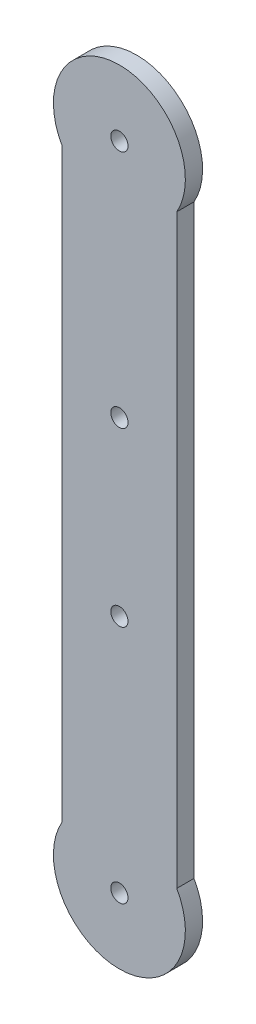
ISO-10303-21;
HEADER;
FILE_DESCRIPTION(('STEP AP214'),'2;1');
FILE_NAME('part.step','',(''),(''),'','','');
FILE_SCHEMA(('AUTOMOTIVE_DESIGN { 1 0 10303 214 1 1 1 1 }'));
ENDSEC;
DATA;
#1=APPLICATION_CONTEXT('core data for automotive mechanical design processes');
#2=APPLICATION_PROTOCOL_DEFINITION('international standard','automotive_design',2000,#1);
#3=PRODUCT_CONTEXT('',#1,'mechanical');
#4=PRODUCT('Part','Part','',(#3));
#5=PRODUCT_RELATED_PRODUCT_CATEGORY('part','',(#4));
#6=PRODUCT_DEFINITION_FORMATION('','',#4);
#7=PRODUCT_DEFINITION_CONTEXT('part definition',#1,'design');
#8=PRODUCT_DEFINITION('design','',#6,#7);
#9=PRODUCT_DEFINITION_SHAPE('','',#8);
#10=(LENGTH_UNIT() NAMED_UNIT(*) SI_UNIT(.MILLI.,.METRE.));
#11=(NAMED_UNIT(*) PLANE_ANGLE_UNIT() SI_UNIT($,.RADIAN.));
#12=(NAMED_UNIT(*) SI_UNIT($,.STERADIAN.) SOLID_ANGLE_UNIT());
#13=UNCERTAINTY_MEASURE_WITH_UNIT(LENGTH_MEASURE(1.E-05),#10,'distance_accuracy_value','');
#14=(GEOMETRIC_REPRESENTATION_CONTEXT(3) GLOBAL_UNCERTAINTY_ASSIGNED_CONTEXT((#13)) GLOBAL_UNIT_ASSIGNED_CONTEXT((#10,
#11,#12)) REPRESENTATION_CONTEXT('',''));
#15=CARTESIAN_POINT('',(0.,0.,0.));
#16=DIRECTION('',(0.,0.,1.));
#17=DIRECTION('',(1.,0.,0.));
#18=AXIS2_PLACEMENT_3D('',#15,#16,#17);
#19=CARTESIAN_POINT('',(0.,-56.75,3.));
#20=DIRECTION('',(0.,0.,-1.));
#21=DIRECTION('',(-1.,0.,0.));
#22=AXIS2_PLACEMENT_3D('',#19,#20,#21);
#23=CYLINDRICAL_SURFACE('',#22,11.5);
#24=CARTESIAN_POINT('',(0.,-56.75,0.));
#25=DIRECTION('',(0.,0.,1.));
#26=DIRECTION('',(1.,0.,0.));
#27=AXIS2_PLACEMENT_3D('',#24,#25,#26);
#28=CIRCLE('',#27,11.5);
#29=CARTESIAN_POINT('',(-10.,-51.0710916541997,0.));
#30=VERTEX_POINT('',#29);
#31=CARTESIAN_POINT('',(10.,-51.0710916541997,0.));
#32=VERTEX_POINT('',#31);
#33=EDGE_CURVE('E109',#30,#32,#28,.T.);
#34=ORIENTED_EDGE('',*,*,#33,.T.);
#35=DIRECTION('',(0.,0.,-1.));
#36=VECTOR('',#35,1.);
#37=CARTESIAN_POINT('',(10.,-51.0710916541997,3.));
#38=LINE('',#37,#36);
#39=CARTESIAN_POINT('',(10.,-51.0710916541997,3.));
#40=VERTEX_POINT('',#39);
#41=EDGE_CURVE('E11',#40,#32,#38,.T.);
#42=ORIENTED_EDGE('',*,*,#41,.F.);
#43=CARTESIAN_POINT('',(0.,-56.75,3.));
#44=DIRECTION('',(0.,0.,1.));
#45=DIRECTION('',(1.,0.,0.));
#46=AXIS2_PLACEMENT_3D('',#43,#44,#45);
#47=CIRCLE('',#46,11.5);
#48=CARTESIAN_POINT('',(-10.,-51.0710916541997,3.));
#49=VERTEX_POINT('',#48);
#50=EDGE_CURVE('E91',#49,#40,#47,.T.);
#51=ORIENTED_EDGE('',*,*,#50,.F.);
#52=DIRECTION('',(0.,0.,-1.));
#53=VECTOR('',#52,1.);
#54=CARTESIAN_POINT('',(-10.,-51.0710916541997,3.));
#55=LINE('',#54,#53);
#56=EDGE_CURVE('E58',#49,#30,#55,.T.);
#57=ORIENTED_EDGE('',*,*,#56,.T.);
#58=EDGE_LOOP('',(#34,#42,#51,#57));
#59=FACE_BOUND('',#58,.T.);
#60=ADVANCED_FACE('F41',(#59),#23,.T.);
#61=CARTESIAN_POINT('',(10.,0.,3.));
#62=DIRECTION('',(-1.,0.,0.));
#63=DIRECTION('',(0.,0.,1.));
#64=AXIS2_PLACEMENT_3D('',#61,#62,#63);
#65=PLANE('',#64);
#66=DIRECTION('',(0.,1.,0.));
#67=VECTOR('',#66,1.);
#68=CARTESIAN_POINT('',(10.,0.,0.));
#69=LINE('',#68,#67);
#70=CARTESIAN_POINT('',(10.,51.0710916541997,0.));
#71=VERTEX_POINT('',#70);
#72=EDGE_CURVE('E97',#32,#71,#69,.T.);
#73=ORIENTED_EDGE('',*,*,#72,.T.);
#74=DIRECTION('',(0.,0.,-1.));
#75=VECTOR('',#74,1.);
#76=CARTESIAN_POINT('',(10.,51.0710916541997,3.));
#77=LINE('',#76,#75);
#78=CARTESIAN_POINT('',(10.,51.0710916541997,3.));
#79=VERTEX_POINT('',#78);
#80=EDGE_CURVE('E50',#79,#71,#77,.T.);
#81=ORIENTED_EDGE('',*,*,#80,.F.);
#82=DIRECTION('',(0.,1.,0.));
#83=VECTOR('',#82,1.);
#84=CARTESIAN_POINT('',(10.,0.,3.));
#85=LINE('',#84,#83);
#86=EDGE_CURVE('E84',#40,#79,#85,.T.);
#87=ORIENTED_EDGE('',*,*,#86,.F.);
#88=ORIENTED_EDGE('',*,*,#41,.T.);
#89=EDGE_LOOP('',(#73,#81,#87,#88));
#90=FACE_BOUND('',#89,.T.);
#91=ADVANCED_FACE('F96',(#90),#65,.F.);
#92=CARTESIAN_POINT('',(0.,56.75,3.));
#93=DIRECTION('',(0.,0.,-1.));
#94=DIRECTION('',(-1.,0.,0.));
#95=AXIS2_PLACEMENT_3D('',#92,#93,#94);
#96=CYLINDRICAL_SURFACE('',#95,11.5);
#97=CARTESIAN_POINT('',(0.,56.75,0.));
#98=DIRECTION('',(0.,0.,1.));
#99=DIRECTION('',(1.,0.,0.));
#100=AXIS2_PLACEMENT_3D('',#97,#98,#99);
#101=CIRCLE('',#100,11.5);
#102=CARTESIAN_POINT('',(-10.,51.0710916541997,0.));
#103=VERTEX_POINT('',#102);
#104=EDGE_CURVE('E115',#71,#103,#101,.T.);
#105=ORIENTED_EDGE('',*,*,#104,.T.);
#106=DIRECTION('',(0.,0.,-1.));
#107=VECTOR('',#106,1.);
#108=CARTESIAN_POINT('',(-10.,51.0710916541997,3.));
#109=LINE('',#108,#107);
#110=CARTESIAN_POINT('',(-10.,51.0710916541997,3.));
#111=VERTEX_POINT('',#110);
#112=EDGE_CURVE('E73',#111,#103,#109,.T.);
#113=ORIENTED_EDGE('',*,*,#112,.F.);
#114=CARTESIAN_POINT('',(0.,56.75,3.));
#115=DIRECTION('',(0.,0.,1.));
#116=DIRECTION('',(1.,0.,0.));
#117=AXIS2_PLACEMENT_3D('',#114,#115,#116);
#118=CIRCLE('',#117,11.5);
#119=EDGE_CURVE('E90',#79,#111,#118,.T.);
#120=ORIENTED_EDGE('',*,*,#119,.F.);
#121=ORIENTED_EDGE('',*,*,#80,.T.);
#122=EDGE_LOOP('',(#105,#113,#120,#121));
#123=FACE_BOUND('',#122,.T.);
#124=ADVANCED_FACE('F101',(#123),#96,.T.);
#125=CARTESIAN_POINT('',(-10.,0.,3.));
#126=DIRECTION('',(-1.,0.,0.));
#127=DIRECTION('',(0.,0.,1.));
#128=AXIS2_PLACEMENT_3D('',#125,#126,#127);
#129=PLANE('',#128);
#130=DIRECTION('',(0.,1.,0.));
#131=VECTOR('',#130,1.);
#132=CARTESIAN_POINT('',(-10.,0.,0.));
#133=LINE('',#132,#131);
#134=EDGE_CURVE('E118',#30,#103,#133,.T.);
#135=ORIENTED_EDGE('',*,*,#134,.F.);
#136=ORIENTED_EDGE('',*,*,#56,.F.);
#137=DIRECTION('',(0.,1.,0.));
#138=VECTOR('',#137,1.);
#139=CARTESIAN_POINT('',(-10.,0.,3.));
#140=LINE('',#139,#138);
#141=EDGE_CURVE('E103',#49,#111,#140,.T.);
#142=ORIENTED_EDGE('',*,*,#141,.T.);
#143=ORIENTED_EDGE('',*,*,#112,.T.);
#144=EDGE_LOOP('',(#135,#136,#142,#143));
#145=FACE_BOUND('',#144,.T.);
#146=ADVANCED_FACE('F173',(#145),#129,.T.);
#147=CARTESIAN_POINT('',(0.,0.,3.));
#148=DIRECTION('',(0.,0.,1.));
#149=DIRECTION('',(1.,0.,0.));
#150=AXIS2_PLACEMENT_3D('',#147,#148,#149);
#151=PLANE('',#150);
#152=CARTESIAN_POINT('',(0.,56.75,3.));
#153=DIRECTION('',(0.,0.,1.));
#154=DIRECTION('',(1.,0.,0.));
#155=AXIS2_PLACEMENT_3D('',#152,#153,#154);
#156=CIRCLE('',#155,1.5);
#157=CARTESIAN_POINT('',(1.5,56.75,3.));
#158=VERTEX_POINT('',#157);
#159=EDGE_CURVE('E136',#158,#158,#156,.T.);
#160=ORIENTED_EDGE('',*,*,#159,.F.);
#161=EDGE_LOOP('',(#160));
#162=FACE_BOUND('',#161,.T.);
#163=CARTESIAN_POINT('',(0.,-56.75,3.));
#164=DIRECTION('',(0.,0.,1.));
#165=DIRECTION('',(1.,0.,0.));
#166=AXIS2_PLACEMENT_3D('',#163,#164,#165);
#167=CIRCLE('',#166,1.5);
#168=CARTESIAN_POINT('',(1.5,-56.75,3.));
#169=VERTEX_POINT('',#168);
#170=EDGE_CURVE('E144',#169,#169,#167,.T.);
#171=ORIENTED_EDGE('',*,*,#170,.F.);
#172=EDGE_LOOP('',(#171));
#173=FACE_BOUND('',#172,.T.);
#174=CARTESIAN_POINT('',(0.,-15.,3.));
#175=DIRECTION('',(0.,0.,1.));
#176=DIRECTION('',(1.,0.,0.));
#177=AXIS2_PLACEMENT_3D('',#174,#175,#176);
#178=CIRCLE('',#177,1.5);
#179=CARTESIAN_POINT('',(1.5,-15.,3.));
#180=VERTEX_POINT('',#179);
#181=EDGE_CURVE('E152',#180,#180,#178,.T.);
#182=ORIENTED_EDGE('',*,*,#181,.F.);
#183=EDGE_LOOP('',(#182));
#184=FACE_BOUND('',#183,.T.);
#185=CARTESIAN_POINT('',(0.,15.,3.));
#186=DIRECTION('',(0.,0.,1.));
#187=DIRECTION('',(1.,0.,0.));
#188=AXIS2_PLACEMENT_3D('',#185,#186,#187);
#189=CIRCLE('',#188,1.5);
#190=CARTESIAN_POINT('',(1.5,15.,3.));
#191=VERTEX_POINT('',#190);
#192=EDGE_CURVE('E128',#191,#191,#189,.T.);
#193=ORIENTED_EDGE('',*,*,#192,.F.);
#194=EDGE_LOOP('',(#193));
#195=FACE_BOUND('',#194,.T.);
#196=ORIENTED_EDGE('',*,*,#50,.T.);
#197=ORIENTED_EDGE('',*,*,#86,.T.);
#198=ORIENTED_EDGE('',*,*,#119,.T.);
#199=ORIENTED_EDGE('',*,*,#141,.F.);
#200=EDGE_LOOP('',(#196,#197,#198,#199));
#201=FACE_BOUND('',#200,.T.);
#202=ADVANCED_FACE('F87',(#162,#173,#184,#195,#201),#151,.T.);
#203=CARTESIAN_POINT('',(0.,0.,0.));
#204=DIRECTION('',(0.,0.,1.));
#205=DIRECTION('',(1.,0.,0.));
#206=AXIS2_PLACEMENT_3D('',#203,#204,#205);
#207=PLANE('',#206);
#208=CARTESIAN_POINT('',(0.,56.75,0.));
#209=DIRECTION('',(0.,0.,1.));
#210=DIRECTION('',(1.,0.,0.));
#211=AXIS2_PLACEMENT_3D('',#208,#209,#210);
#212=CIRCLE('',#211,1.5);
#213=CARTESIAN_POINT('',(1.5,56.75,0.));
#214=VERTEX_POINT('',#213);
#215=EDGE_CURVE('E140',#214,#214,#212,.T.);
#216=ORIENTED_EDGE('',*,*,#215,.T.);
#217=EDGE_LOOP('',(#216));
#218=FACE_BOUND('',#217,.T.);
#219=CARTESIAN_POINT('',(0.,-56.75,0.));
#220=DIRECTION('',(0.,0.,1.));
#221=DIRECTION('',(1.,0.,0.));
#222=AXIS2_PLACEMENT_3D('',#219,#220,#221);
#223=CIRCLE('',#222,1.5);
#224=CARTESIAN_POINT('',(1.5,-56.75,0.));
#225=VERTEX_POINT('',#224);
#226=EDGE_CURVE('E148',#225,#225,#223,.T.);
#227=ORIENTED_EDGE('',*,*,#226,.T.);
#228=EDGE_LOOP('',(#227));
#229=FACE_BOUND('',#228,.T.);
#230=CARTESIAN_POINT('',(0.,-15.,0.));
#231=DIRECTION('',(0.,0.,1.));
#232=DIRECTION('',(1.,0.,0.));
#233=AXIS2_PLACEMENT_3D('',#230,#231,#232);
#234=CIRCLE('',#233,1.5);
#235=CARTESIAN_POINT('',(1.5,-15.,0.));
#236=VERTEX_POINT('',#235);
#237=EDGE_CURVE('E132',#236,#236,#234,.T.);
#238=ORIENTED_EDGE('',*,*,#237,.T.);
#239=EDGE_LOOP('',(#238));
#240=FACE_BOUND('',#239,.T.);
#241=CARTESIAN_POINT('',(0.,15.,0.));
#242=DIRECTION('',(0.,0.,1.));
#243=DIRECTION('',(1.,0.,0.));
#244=AXIS2_PLACEMENT_3D('',#241,#242,#243);
#245=CIRCLE('',#244,1.5);
#246=CARTESIAN_POINT('',(1.5,15.,0.));
#247=VERTEX_POINT('',#246);
#248=EDGE_CURVE('E112',#247,#247,#245,.T.);
#249=ORIENTED_EDGE('',*,*,#248,.T.);
#250=EDGE_LOOP('',(#249));
#251=FACE_BOUND('',#250,.T.);
#252=ORIENTED_EDGE('',*,*,#33,.F.);
#253=ORIENTED_EDGE('',*,*,#134,.T.);
#254=ORIENTED_EDGE('',*,*,#104,.F.);
#255=ORIENTED_EDGE('',*,*,#72,.F.);
#256=EDGE_LOOP('',(#252,#253,#254,#255));
#257=FACE_BOUND('',#256,.T.);
#258=ADVANCED_FACE('F160',(#218,#229,#240,#251,#257),#207,.F.);
#259=CARTESIAN_POINT('',(0.,15.,0.));
#260=DIRECTION('',(0.,0.,1.));
#261=DIRECTION('',(1.,0.,0.));
#262=AXIS2_PLACEMENT_3D('',#259,#260,#261);
#263=CYLINDRICAL_SURFACE('',#262,1.5);
#264=ORIENTED_EDGE('',*,*,#248,.F.);
#265=EDGE_LOOP('',(#264));
#266=FACE_BOUND('',#265,.T.);
#267=ORIENTED_EDGE('',*,*,#192,.T.);
#268=EDGE_LOOP('',(#267));
#269=FACE_BOUND('',#268,.T.);
#270=ADVANCED_FACE('F167',(#266,#269),#263,.F.);
#271=CARTESIAN_POINT('',(0.,-15.,0.));
#272=DIRECTION('',(0.,0.,1.));
#273=DIRECTION('',(1.,0.,0.));
#274=AXIS2_PLACEMENT_3D('',#271,#272,#273);
#275=CYLINDRICAL_SURFACE('',#274,1.5);
#276=ORIENTED_EDGE('',*,*,#237,.F.);
#277=EDGE_LOOP('',(#276));
#278=FACE_BOUND('',#277,.T.);
#279=ORIENTED_EDGE('',*,*,#181,.T.);
#280=EDGE_LOOP('',(#279));
#281=FACE_BOUND('',#280,.T.);
#282=ADVANCED_FACE('F163',(#278,#281),#275,.F.);
#283=CARTESIAN_POINT('',(0.,-56.75,0.));
#284=DIRECTION('',(0.,0.,1.));
#285=DIRECTION('',(1.,0.,0.));
#286=AXIS2_PLACEMENT_3D('',#283,#284,#285);
#287=CYLINDRICAL_SURFACE('',#286,1.5);
#288=ORIENTED_EDGE('',*,*,#226,.F.);
#289=EDGE_LOOP('',(#288));
#290=FACE_BOUND('',#289,.T.);
#291=ORIENTED_EDGE('',*,*,#170,.T.);
#292=EDGE_LOOP('',(#291));
#293=FACE_BOUND('',#292,.T.);
#294=ADVANCED_FACE('F166',(#290,#293),#287,.F.);
#295=CARTESIAN_POINT('',(0.,56.75,0.));
#296=DIRECTION('',(0.,0.,1.));
#297=DIRECTION('',(1.,0.,0.));
#298=AXIS2_PLACEMENT_3D('',#295,#296,#297);
#299=CYLINDRICAL_SURFACE('',#298,1.5);
#300=ORIENTED_EDGE('',*,*,#215,.F.);
#301=EDGE_LOOP('',(#300));
#302=FACE_BOUND('',#301,.T.);
#303=ORIENTED_EDGE('',*,*,#159,.T.);
#304=EDGE_LOOP('',(#303));
#305=FACE_BOUND('',#304,.T.);
#306=ADVANCED_FACE('F255',(#302,#305),#299,.F.);
#307=CLOSED_SHELL('',(#60,#91,#124,#146,#202,#258,#270,#282,#294,#306));
#308=MANIFOLD_SOLID_BREP('B2',#307);
#309=ADVANCED_BREP_SHAPE_REPRESENTATION('',(#18,#308),#14);
#310=SHAPE_DEFINITION_REPRESENTATION(#9,#309);
ENDSEC;
END-ISO-10303-21;
